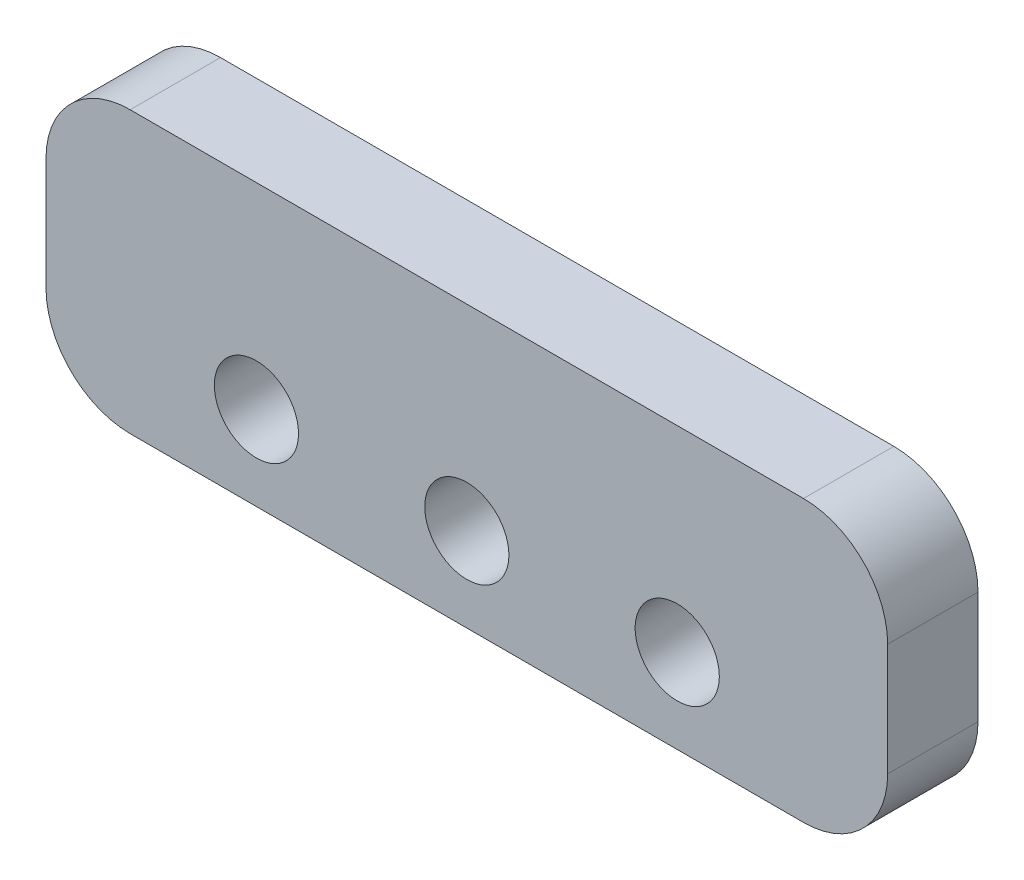
ISO-10303-21;
HEADER;
FILE_DESCRIPTION(('STEP AP214'),'2;1');
FILE_NAME('part.step','',(''),(''),'','','');
FILE_SCHEMA(('AUTOMOTIVE_DESIGN { 1 0 10303 214 1 1 1 1 }'));
ENDSEC;
DATA;
#1=APPLICATION_CONTEXT('core data for automotive mechanical design processes');
#2=APPLICATION_PROTOCOL_DEFINITION('international standard','automotive_design',2000,#1);
#3=PRODUCT_CONTEXT('',#1,'mechanical');
#4=PRODUCT('Part','Part','',(#3));
#5=PRODUCT_RELATED_PRODUCT_CATEGORY('part','',(#4));
#6=PRODUCT_DEFINITION_FORMATION('','',#4);
#7=PRODUCT_DEFINITION_CONTEXT('part definition',#1,'design');
#8=PRODUCT_DEFINITION('design','',#6,#7);
#9=PRODUCT_DEFINITION_SHAPE('','',#8);
#10=(LENGTH_UNIT() NAMED_UNIT(*) SI_UNIT(.MILLI.,.METRE.));
#11=(NAMED_UNIT(*) PLANE_ANGLE_UNIT() SI_UNIT($,.RADIAN.));
#12=(NAMED_UNIT(*) SI_UNIT($,.STERADIAN.) SOLID_ANGLE_UNIT());
#13=UNCERTAINTY_MEASURE_WITH_UNIT(LENGTH_MEASURE(1.E-05),#10,'distance_accuracy_value','');
#14=(GEOMETRIC_REPRESENTATION_CONTEXT(3) GLOBAL_UNCERTAINTY_ASSIGNED_CONTEXT((#13)) GLOBAL_UNIT_ASSIGNED_CONTEXT((#10,
#11,#12)) REPRESENTATION_CONTEXT('',''));
#15=CARTESIAN_POINT('',(0.,0.,0.));
#16=DIRECTION('',(0.,0.,1.));
#17=DIRECTION('',(1.,0.,0.));
#18=AXIS2_PLACEMENT_3D('',#15,#16,#17);
#19=CARTESIAN_POINT('',(0.,0.,1.61));
#20=DIRECTION('',(0.,0.,-1.));
#21=DIRECTION('',(-1.,0.,0.));
#22=AXIS2_PLACEMENT_3D('',#19,#20,#21);
#23=PLANE('',#22);
#24=DIRECTION('',(1.,0.,0.));
#25=VECTOR('',#24,1.);
#26=CARTESIAN_POINT('',(15.,-3.,1.61));
#27=LINE('',#26,#25);
#28=CARTESIAN_POINT('',(-12.,-3.,1.61));
#29=VERTEX_POINT('',#28);
#30=CARTESIAN_POINT('',(12.,-3.,1.61));
#31=VERTEX_POINT('',#30);
#32=EDGE_CURVE('E153',#29,#31,#27,.T.);
#33=ORIENTED_EDGE('',*,*,#32,.T.);
#34=CARTESIAN_POINT('',(12.,0.,1.61));
#35=DIRECTION('',(0.,0.,-1.));
#36=DIRECTION('',(-1.,0.,0.));
#37=AXIS2_PLACEMENT_3D('',#34,#35,#36);
#38=CIRCLE('',#37,3.);
#39=CARTESIAN_POINT('',(15.,0.,1.61));
#40=VERTEX_POINT('',#39);
#41=EDGE_CURVE('E183',#31,#40,#38,.F.);
#42=ORIENTED_EDGE('',*,*,#41,.T.);
#43=DIRECTION('',(0.,1.,0.));
#44=VECTOR('',#43,1.);
#45=CARTESIAN_POINT('',(15.,7.,1.61));
#46=LINE('',#45,#44);
#47=CARTESIAN_POINT('',(15.,4.,1.61));
#48=VERTEX_POINT('',#47);
#49=EDGE_CURVE('E132',#40,#48,#46,.T.);
#50=ORIENTED_EDGE('',*,*,#49,.T.);
#51=CARTESIAN_POINT('',(12.,4.,1.61));
#52=DIRECTION('',(0.,0.,-1.));
#53=DIRECTION('',(-1.,0.,0.));
#54=AXIS2_PLACEMENT_3D('',#51,#52,#53);
#55=CIRCLE('',#54,3.);
#56=CARTESIAN_POINT('',(12.,7.,1.61));
#57=VERTEX_POINT('',#56);
#58=EDGE_CURVE('E180',#48,#57,#55,.F.);
#59=ORIENTED_EDGE('',*,*,#58,.T.);
#60=DIRECTION('',(-1.,0.,0.));
#61=VECTOR('',#60,1.);
#62=CARTESIAN_POINT('',(-15.,7.,1.61));
#63=LINE('',#62,#61);
#64=CARTESIAN_POINT('',(-12.,7.,1.61));
#65=VERTEX_POINT('',#64);
#66=EDGE_CURVE('E209',#57,#65,#63,.T.);
#67=ORIENTED_EDGE('',*,*,#66,.T.);
#68=CARTESIAN_POINT('',(-12.,4.,1.61));
#69=DIRECTION('',(0.,0.,-1.));
#70=DIRECTION('',(-1.,0.,0.));
#71=AXIS2_PLACEMENT_3D('',#68,#69,#70);
#72=CIRCLE('',#71,3.);
#73=CARTESIAN_POINT('',(-15.,4.,1.61));
#74=VERTEX_POINT('',#73);
#75=EDGE_CURVE('E66',#65,#74,#72,.F.);
#76=ORIENTED_EDGE('',*,*,#75,.T.);
#77=DIRECTION('',(0.,-1.,0.));
#78=VECTOR('',#77,1.);
#79=CARTESIAN_POINT('',(-15.,-3.,1.61));
#80=LINE('',#79,#78);
#81=CARTESIAN_POINT('',(-15.,0.,1.61));
#82=VERTEX_POINT('',#81);
#83=EDGE_CURVE('E197',#74,#82,#80,.T.);
#84=ORIENTED_EDGE('',*,*,#83,.T.);
#85=CARTESIAN_POINT('',(-12.,0.,1.61));
#86=DIRECTION('',(0.,0.,-1.));
#87=DIRECTION('',(-1.,0.,0.));
#88=AXIS2_PLACEMENT_3D('',#85,#86,#87);
#89=CIRCLE('',#88,3.);
#90=EDGE_CURVE('E177',#82,#29,#89,.F.);
#91=ORIENTED_EDGE('',*,*,#90,.T.);
#92=EDGE_LOOP('',(#33,#42,#50,#59,#67,#76,#84,#91));
#93=FACE_BOUND('',#92,.T.);
#94=CARTESIAN_POINT('',(0.,0.,1.61));
#95=DIRECTION('',(0.,0.,1.));
#96=DIRECTION('',(1.,0.,0.));
#97=AXIS2_PLACEMENT_3D('',#94,#95,#96);
#98=CIRCLE('',#97,1.5);
#99=CARTESIAN_POINT('',(1.5,0.,1.61));
#100=VERTEX_POINT('',#99);
#101=EDGE_CURVE('E142',#100,#100,#98,.T.);
#102=ORIENTED_EDGE('',*,*,#101,.F.);
#103=EDGE_LOOP('',(#102));
#104=FACE_BOUND('',#103,.T.);
#105=CARTESIAN_POINT('',(-7.5,0.,1.61));
#106=DIRECTION('',(0.,0.,1.));
#107=DIRECTION('',(1.,0.,0.));
#108=AXIS2_PLACEMENT_3D('',#105,#106,#107);
#109=CIRCLE('',#108,1.5);
#110=CARTESIAN_POINT('',(-6.,0.,1.61));
#111=VERTEX_POINT('',#110);
#112=EDGE_CURVE('E217',#111,#111,#109,.T.);
#113=ORIENTED_EDGE('',*,*,#112,.F.);
#114=EDGE_LOOP('',(#113));
#115=FACE_BOUND('',#114,.T.);
#116=CARTESIAN_POINT('',(7.5,0.,1.61));
#117=DIRECTION('',(0.,0.,1.));
#118=DIRECTION('',(1.,0.,0.));
#119=AXIS2_PLACEMENT_3D('',#116,#117,#118);
#120=CIRCLE('',#119,1.5);
#121=CARTESIAN_POINT('',(9.,0.,1.61));
#122=VERTEX_POINT('',#121);
#123=EDGE_CURVE('E223',#122,#122,#120,.T.);
#124=ORIENTED_EDGE('',*,*,#123,.F.);
#125=EDGE_LOOP('',(#124));
#126=FACE_BOUND('',#125,.T.);
#127=ADVANCED_FACE('F45',(#93,#104,#115,#126),#23,.F.);
#128=CARTESIAN_POINT('',(0.,0.,-1.61));
#129=DIRECTION('',(0.,0.,-1.));
#130=DIRECTION('',(-1.,0.,0.));
#131=AXIS2_PLACEMENT_3D('',#128,#129,#130);
#132=PLANE('',#131);
#133=CARTESIAN_POINT('',(-7.5,0.,-1.61));
#134=DIRECTION('',(0.,0.,1.));
#135=DIRECTION('',(1.,0.,0.));
#136=AXIS2_PLACEMENT_3D('',#133,#134,#135);
#137=CIRCLE('',#136,1.5);
#138=CARTESIAN_POINT('',(-6.,0.,-1.61));
#139=VERTEX_POINT('',#138);
#140=EDGE_CURVE('E219',#139,#139,#137,.T.);
#141=ORIENTED_EDGE('',*,*,#140,.T.);
#142=EDGE_LOOP('',(#141));
#143=FACE_BOUND('',#142,.T.);
#144=DIRECTION('',(0.,1.,0.));
#145=VECTOR('',#144,1.);
#146=CARTESIAN_POINT('',(15.,7.,-1.61));
#147=LINE('',#146,#145);
#148=CARTESIAN_POINT('',(15.,0.,-1.61));
#149=VERTEX_POINT('',#148);
#150=CARTESIAN_POINT('',(15.,4.,-1.61));
#151=VERTEX_POINT('',#150);
#152=EDGE_CURVE('E129',#149,#151,#147,.T.);
#153=ORIENTED_EDGE('',*,*,#152,.F.);
#154=CARTESIAN_POINT('',(12.,0.,-1.61));
#155=DIRECTION('',(0.,0.,-1.));
#156=DIRECTION('',(-1.,0.,0.));
#157=AXIS2_PLACEMENT_3D('',#154,#155,#156);
#158=CIRCLE('',#157,3.);
#159=CARTESIAN_POINT('',(12.,-3.,-1.61));
#160=VERTEX_POINT('',#159);
#161=EDGE_CURVE('E111',#149,#160,#158,.T.);
#162=ORIENTED_EDGE('',*,*,#161,.T.);
#163=DIRECTION('',(1.,0.,0.));
#164=VECTOR('',#163,1.);
#165=CARTESIAN_POINT('',(15.,-3.,-1.61));
#166=LINE('',#165,#164);
#167=CARTESIAN_POINT('',(-12.,-3.,-1.61));
#168=VERTEX_POINT('',#167);
#169=EDGE_CURVE('E158',#168,#160,#166,.T.);
#170=ORIENTED_EDGE('',*,*,#169,.F.);
#171=CARTESIAN_POINT('',(-12.,0.,-1.61));
#172=DIRECTION('',(0.,0.,-1.));
#173=DIRECTION('',(-1.,0.,0.));
#174=AXIS2_PLACEMENT_3D('',#171,#172,#173);
#175=CIRCLE('',#174,3.);
#176=CARTESIAN_POINT('',(-15.,0.,-1.61));
#177=VERTEX_POINT('',#176);
#178=EDGE_CURVE('E165',#168,#177,#175,.T.);
#179=ORIENTED_EDGE('',*,*,#178,.T.);
#180=DIRECTION('',(0.,-1.,0.));
#181=VECTOR('',#180,1.);
#182=CARTESIAN_POINT('',(-15.,-3.,-1.61));
#183=LINE('',#182,#181);
#184=CARTESIAN_POINT('',(-15.,4.,-1.61));
#185=VERTEX_POINT('',#184);
#186=EDGE_CURVE('E147',#185,#177,#183,.T.);
#187=ORIENTED_EDGE('',*,*,#186,.F.);
#188=CARTESIAN_POINT('',(-12.,4.,-1.61));
#189=DIRECTION('',(0.,0.,-1.));
#190=DIRECTION('',(-1.,0.,0.));
#191=AXIS2_PLACEMENT_3D('',#188,#189,#190);
#192=CIRCLE('',#191,3.);
#193=CARTESIAN_POINT('',(-12.,7.,-1.61));
#194=VERTEX_POINT('',#193);
#195=EDGE_CURVE('E134',#185,#194,#192,.T.);
#196=ORIENTED_EDGE('',*,*,#195,.T.);
#197=DIRECTION('',(-1.,0.,0.));
#198=VECTOR('',#197,1.);
#199=CARTESIAN_POINT('',(-15.,7.,-1.61));
#200=LINE('',#199,#198);
#201=CARTESIAN_POINT('',(12.,7.,-1.61));
#202=VERTEX_POINT('',#201);
#203=EDGE_CURVE('E141',#202,#194,#200,.T.);
#204=ORIENTED_EDGE('',*,*,#203,.F.);
#205=CARTESIAN_POINT('',(12.,4.,-1.61));
#206=DIRECTION('',(0.,0.,-1.));
#207=DIRECTION('',(-1.,0.,0.));
#208=AXIS2_PLACEMENT_3D('',#205,#206,#207);
#209=CIRCLE('',#208,3.);
#210=EDGE_CURVE('E123',#202,#151,#209,.T.);
#211=ORIENTED_EDGE('',*,*,#210,.T.);
#212=EDGE_LOOP('',(#153,#162,#170,#179,#187,#196,#204,#211));
#213=FACE_BOUND('',#212,.T.);
#214=CARTESIAN_POINT('',(0.,0.,-1.61));
#215=DIRECTION('',(0.,0.,1.));
#216=DIRECTION('',(1.,0.,0.));
#217=AXIS2_PLACEMENT_3D('',#214,#215,#216);
#218=CIRCLE('',#217,1.5);
#219=CARTESIAN_POINT('',(1.5,0.,-1.61));
#220=VERTEX_POINT('',#219);
#221=EDGE_CURVE('E150',#220,#220,#218,.T.);
#222=ORIENTED_EDGE('',*,*,#221,.T.);
#223=EDGE_LOOP('',(#222));
#224=FACE_BOUND('',#223,.T.);
#225=CARTESIAN_POINT('',(7.5,0.,-1.61));
#226=DIRECTION('',(0.,0.,1.));
#227=DIRECTION('',(1.,0.,0.));
#228=AXIS2_PLACEMENT_3D('',#225,#226,#227);
#229=CIRCLE('',#228,1.5);
#230=CARTESIAN_POINT('',(9.,0.,-1.61));
#231=VERTEX_POINT('',#230);
#232=EDGE_CURVE('E227',#231,#231,#229,.T.);
#233=ORIENTED_EDGE('',*,*,#232,.T.);
#234=EDGE_LOOP('',(#233));
#235=FACE_BOUND('',#234,.T.);
#236=ADVANCED_FACE('F137',(#143,#213,#224,#235),#132,.T.);
#237=CARTESIAN_POINT('',(15.,7.,1.61));
#238=DIRECTION('',(-1.,0.,0.));
#239=DIRECTION('',(0.,-1.,0.));
#240=AXIS2_PLACEMENT_3D('',#237,#238,#239);
#241=PLANE('',#240);
#242=ORIENTED_EDGE('',*,*,#49,.F.);
#243=DIRECTION('',(0.,0.,-1.));
#244=VECTOR('',#243,1.);
#245=CARTESIAN_POINT('',(15.,0.,1.61));
#246=LINE('',#245,#244);
#247=EDGE_CURVE('E115',#40,#149,#246,.T.);
#248=ORIENTED_EDGE('',*,*,#247,.T.);
#249=ORIENTED_EDGE('',*,*,#152,.T.);
#250=DIRECTION('',(0.,0.,-1.));
#251=VECTOR('',#250,1.);
#252=CARTESIAN_POINT('',(15.,4.,1.61));
#253=LINE('',#252,#251);
#254=EDGE_CURVE('E135',#151,#48,#253,.F.);
#255=ORIENTED_EDGE('',*,*,#254,.T.);
#256=EDGE_LOOP('',(#242,#248,#249,#255));
#257=FACE_BOUND('',#256,.T.);
#258=ADVANCED_FACE('F128',(#257),#241,.F.);
#259=CARTESIAN_POINT('',(-15.,7.,1.61));
#260=DIRECTION('',(0.,-1.,0.));
#261=DIRECTION('',(0.,0.,-1.));
#262=AXIS2_PLACEMENT_3D('',#259,#260,#261);
#263=PLANE('',#262);
#264=ORIENTED_EDGE('',*,*,#66,.F.);
#265=DIRECTION('',(0.,0.,-1.));
#266=VECTOR('',#265,1.);
#267=CARTESIAN_POINT('',(12.,7.,1.61));
#268=LINE('',#267,#266);
#269=EDGE_CURVE('E189',#57,#202,#268,.T.);
#270=ORIENTED_EDGE('',*,*,#269,.T.);
#271=ORIENTED_EDGE('',*,*,#203,.T.);
#272=DIRECTION('',(0.,0.,-1.));
#273=VECTOR('',#272,1.);
#274=CARTESIAN_POINT('',(-12.,7.,1.61));
#275=LINE('',#274,#273);
#276=EDGE_CURVE('E186',#194,#65,#275,.F.);
#277=ORIENTED_EDGE('',*,*,#276,.T.);
#278=EDGE_LOOP('',(#264,#270,#271,#277));
#279=FACE_BOUND('',#278,.T.);
#280=ADVANCED_FACE('F254',(#279),#263,.F.);
#281=CARTESIAN_POINT('',(-15.,-3.,1.61));
#282=DIRECTION('',(1.,0.,0.));
#283=DIRECTION('',(0.,0.,-1.));
#284=AXIS2_PLACEMENT_3D('',#281,#282,#283);
#285=PLANE('',#284);
#286=ORIENTED_EDGE('',*,*,#186,.T.);
#287=DIRECTION('',(0.,0.,-1.));
#288=VECTOR('',#287,1.);
#289=CARTESIAN_POINT('',(-15.,0.,1.61));
#290=LINE('',#289,#288);
#291=EDGE_CURVE('E11',#177,#82,#290,.F.);
#292=ORIENTED_EDGE('',*,*,#291,.T.);
#293=ORIENTED_EDGE('',*,*,#83,.F.);
#294=DIRECTION('',(0.,0.,-1.));
#295=VECTOR('',#294,1.);
#296=CARTESIAN_POINT('',(-15.,4.,1.61));
#297=LINE('',#296,#295);
#298=EDGE_CURVE('E54',#74,#185,#297,.T.);
#299=ORIENTED_EDGE('',*,*,#298,.T.);
#300=EDGE_LOOP('',(#286,#292,#293,#299));
#301=FACE_BOUND('',#300,.T.);
#302=ADVANCED_FACE('F196',(#301),#285,.F.);
#303=CARTESIAN_POINT('',(15.,-3.,1.61));
#304=DIRECTION('',(0.,1.,0.));
#305=DIRECTION('',(-1.,0.,0.));
#306=AXIS2_PLACEMENT_3D('',#303,#304,#305);
#307=PLANE('',#306);
#308=ORIENTED_EDGE('',*,*,#169,.T.);
#309=DIRECTION('',(0.,0.,-1.));
#310=VECTOR('',#309,1.);
#311=CARTESIAN_POINT('',(12.,-3.,1.61));
#312=LINE('',#311,#310);
#313=EDGE_CURVE('E116',#160,#31,#312,.F.);
#314=ORIENTED_EDGE('',*,*,#313,.T.);
#315=ORIENTED_EDGE('',*,*,#32,.F.);
#316=DIRECTION('',(0.,0.,-1.));
#317=VECTOR('',#316,1.);
#318=CARTESIAN_POINT('',(-12.,-3.,1.61));
#319=LINE('',#318,#317);
#320=EDGE_CURVE('E122',#29,#168,#319,.T.);
#321=ORIENTED_EDGE('',*,*,#320,.T.);
#322=EDGE_LOOP('',(#308,#314,#315,#321));
#323=FACE_BOUND('',#322,.T.);
#324=ADVANCED_FACE('F205',(#323),#307,.F.);
#325=CARTESIAN_POINT('',(0.,0.,1.61));
#326=DIRECTION('',(0.,0.,-1.));
#327=DIRECTION('',(-1.,0.,0.));
#328=AXIS2_PLACEMENT_3D('',#325,#326,#327);
#329=CYLINDRICAL_SURFACE('',#328,1.5);
#330=ORIENTED_EDGE('',*,*,#101,.T.);
#331=EDGE_LOOP('',(#330));
#332=FACE_BOUND('',#331,.T.);
#333=ORIENTED_EDGE('',*,*,#221,.F.);
#334=EDGE_LOOP('',(#333));
#335=FACE_BOUND('',#334,.T.);
#336=ADVANCED_FACE('F247',(#332,#335),#329,.F.);
#337=CARTESIAN_POINT('',(-7.5,0.,1.61));
#338=DIRECTION('',(0.,0.,-1.));
#339=DIRECTION('',(-1.,0.,0.));
#340=AXIS2_PLACEMENT_3D('',#337,#338,#339);
#341=CYLINDRICAL_SURFACE('',#340,1.5);
#342=ORIENTED_EDGE('',*,*,#112,.T.);
#343=EDGE_LOOP('',(#342));
#344=FACE_BOUND('',#343,.T.);
#345=ORIENTED_EDGE('',*,*,#140,.F.);
#346=EDGE_LOOP('',(#345));
#347=FACE_BOUND('',#346,.T.);
#348=ADVANCED_FACE('F301',(#344,#347),#341,.F.);
#349=CARTESIAN_POINT('',(7.5,0.,1.61));
#350=DIRECTION('',(0.,0.,-1.));
#351=DIRECTION('',(-1.,0.,0.));
#352=AXIS2_PLACEMENT_3D('',#349,#350,#351);
#353=CYLINDRICAL_SURFACE('',#352,1.5);
#354=ORIENTED_EDGE('',*,*,#123,.T.);
#355=EDGE_LOOP('',(#354));
#356=FACE_BOUND('',#355,.T.);
#357=ORIENTED_EDGE('',*,*,#232,.F.);
#358=EDGE_LOOP('',(#357));
#359=FACE_BOUND('',#358,.T.);
#360=ADVANCED_FACE('F235',(#356,#359),#353,.F.);
#361=CARTESIAN_POINT('',(12.,0.,1.61));
#362=DIRECTION('',(0.,0.,-1.));
#363=DIRECTION('',(-1.,0.,0.));
#364=AXIS2_PLACEMENT_3D('',#361,#362,#363);
#365=CYLINDRICAL_SURFACE('',#364,3.);
#366=ORIENTED_EDGE('',*,*,#41,.F.);
#367=ORIENTED_EDGE('',*,*,#313,.F.);
#368=ORIENTED_EDGE('',*,*,#161,.F.);
#369=ORIENTED_EDGE('',*,*,#247,.F.);
#370=EDGE_LOOP('',(#366,#367,#368,#369));
#371=FACE_BOUND('',#370,.T.);
#372=ADVANCED_FACE('F114',(#371),#365,.T.);
#373=CARTESIAN_POINT('',(12.,4.,1.61));
#374=DIRECTION('',(0.,0.,-1.));
#375=DIRECTION('',(-1.,0.,0.));
#376=AXIS2_PLACEMENT_3D('',#373,#374,#375);
#377=CYLINDRICAL_SURFACE('',#376,3.);
#378=ORIENTED_EDGE('',*,*,#58,.F.);
#379=ORIENTED_EDGE('',*,*,#254,.F.);
#380=ORIENTED_EDGE('',*,*,#210,.F.);
#381=ORIENTED_EDGE('',*,*,#269,.F.);
#382=EDGE_LOOP('',(#378,#379,#380,#381));
#383=FACE_BOUND('',#382,.T.);
#384=ADVANCED_FACE('F262',(#383),#377,.T.);
#385=CARTESIAN_POINT('',(-12.,0.,1.61));
#386=DIRECTION('',(0.,0.,-1.));
#387=DIRECTION('',(-1.,0.,0.));
#388=AXIS2_PLACEMENT_3D('',#385,#386,#387);
#389=CYLINDRICAL_SURFACE('',#388,3.);
#390=ORIENTED_EDGE('',*,*,#90,.F.);
#391=ORIENTED_EDGE('',*,*,#291,.F.);
#392=ORIENTED_EDGE('',*,*,#178,.F.);
#393=ORIENTED_EDGE('',*,*,#320,.F.);
#394=EDGE_LOOP('',(#390,#391,#392,#393));
#395=FACE_BOUND('',#394,.T.);
#396=ADVANCED_FACE('F202',(#395),#389,.T.);
#397=CARTESIAN_POINT('',(-12.,4.,1.61));
#398=DIRECTION('',(0.,0.,-1.));
#399=DIRECTION('',(-1.,0.,0.));
#400=AXIS2_PLACEMENT_3D('',#397,#398,#399);
#401=CYLINDRICAL_SURFACE('',#400,3.);
#402=ORIENTED_EDGE('',*,*,#75,.F.);
#403=ORIENTED_EDGE('',*,*,#276,.F.);
#404=ORIENTED_EDGE('',*,*,#195,.F.);
#405=ORIENTED_EDGE('',*,*,#298,.F.);
#406=EDGE_LOOP('',(#402,#403,#404,#405));
#407=FACE_BOUND('',#406,.T.);
#408=ADVANCED_FACE('F47',(#407),#401,.T.);
#409=CLOSED_SHELL('',(#127,#236,#258,#280,#302,#324,#336,#348,#360,#372,#384,#396,#408));
#410=MANIFOLD_SOLID_BREP('B2',#409);
#411=ADVANCED_BREP_SHAPE_REPRESENTATION('',(#18,#410),#14);
#412=SHAPE_DEFINITION_REPRESENTATION(#9,#411);
ENDSEC;
END-ISO-10303-21;
